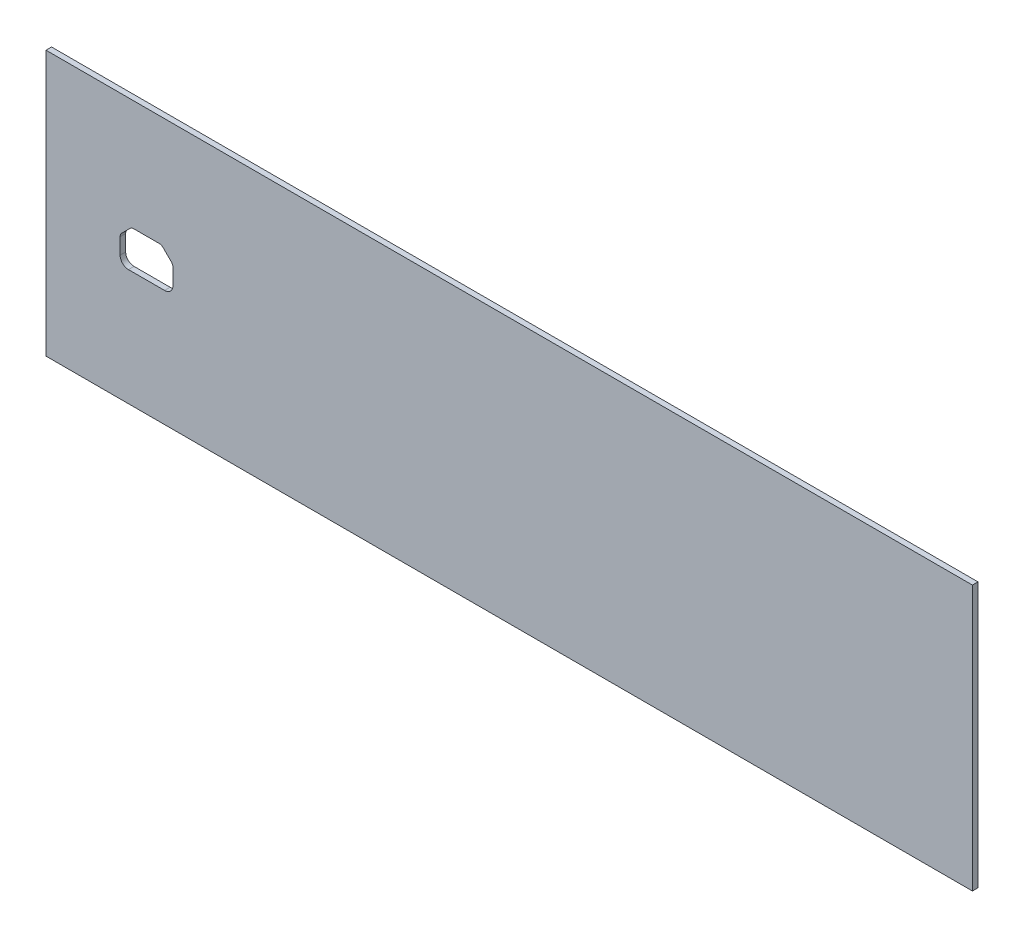
ISO-10303-21;
HEADER;
FILE_DESCRIPTION(('STEP AP214'),'2;1');
FILE_NAME('part.step','',(''),(''),'','','');
FILE_SCHEMA(('AUTOMOTIVE_DESIGN { 1 0 10303 214 1 1 1 1 }'));
ENDSEC;
DATA;
#1=APPLICATION_CONTEXT('core data for automotive mechanical design processes');
#2=APPLICATION_PROTOCOL_DEFINITION('international standard','automotive_design',2000,#1);
#3=PRODUCT_CONTEXT('',#1,'mechanical');
#4=PRODUCT('Part','Part','',(#3));
#5=PRODUCT_RELATED_PRODUCT_CATEGORY('part','',(#4));
#6=PRODUCT_DEFINITION_FORMATION('','',#4);
#7=PRODUCT_DEFINITION_CONTEXT('part definition',#1,'design');
#8=PRODUCT_DEFINITION('design','',#6,#7);
#9=PRODUCT_DEFINITION_SHAPE('','',#8);
#10=(LENGTH_UNIT() NAMED_UNIT(*) SI_UNIT(.MILLI.,.METRE.));
#11=(NAMED_UNIT(*) PLANE_ANGLE_UNIT() SI_UNIT($,.RADIAN.));
#12=(NAMED_UNIT(*) SI_UNIT($,.STERADIAN.) SOLID_ANGLE_UNIT());
#13=UNCERTAINTY_MEASURE_WITH_UNIT(LENGTH_MEASURE(1.E-05),#10,'distance_accuracy_value','');
#14=(GEOMETRIC_REPRESENTATION_CONTEXT(3) GLOBAL_UNCERTAINTY_ASSIGNED_CONTEXT((#13)) GLOBAL_UNIT_ASSIGNED_CONTEXT((#10,
#11,#12)) REPRESENTATION_CONTEXT('',''));
#15=CARTESIAN_POINT('',(0.,0.,0.));
#16=DIRECTION('',(0.,0.,1.));
#17=DIRECTION('',(1.,0.,0.));
#18=AXIS2_PLACEMENT_3D('',#15,#16,#17);
#19=CARTESIAN_POINT('',(0.,0.,3.));
#20=DIRECTION('',(0.,0.,-1.));
#21=DIRECTION('',(-1.,0.,0.));
#22=AXIS2_PLACEMENT_3D('',#19,#20,#21);
#23=PLANE('',#22);
#24=DIRECTION('',(1.,0.,0.));
#25=VECTOR('',#24,1.);
#26=CARTESIAN_POINT('',(250.,-71.5,3.));
#27=LINE('',#26,#25);
#28=CARTESIAN_POINT('',(-250.,-71.5,3.));
#29=VERTEX_POINT('',#28);
#30=CARTESIAN_POINT('',(250.,-71.5,3.));
#31=VERTEX_POINT('',#30);
#32=EDGE_CURVE('E290',#29,#31,#27,.T.);
#33=ORIENTED_EDGE('',*,*,#32,.T.);
#34=DIRECTION('',(0.,1.,0.));
#35=VECTOR('',#34,1.);
#36=CARTESIAN_POINT('',(250.,71.5,3.));
#37=LINE('',#36,#35);
#38=CARTESIAN_POINT('',(250.,71.5,3.));
#39=VERTEX_POINT('',#38);
#40=EDGE_CURVE('E293',#31,#39,#37,.T.);
#41=ORIENTED_EDGE('',*,*,#40,.T.);
#42=DIRECTION('',(-1.,0.,0.));
#43=VECTOR('',#42,1.);
#44=CARTESIAN_POINT('',(-250.,71.5,3.));
#45=LINE('',#44,#43);
#46=CARTESIAN_POINT('',(-250.,71.5,3.));
#47=VERTEX_POINT('',#46);
#48=EDGE_CURVE('E296',#39,#47,#45,.T.);
#49=ORIENTED_EDGE('',*,*,#48,.T.);
#50=DIRECTION('',(0.,-1.,0.));
#51=VECTOR('',#50,1.);
#52=CARTESIAN_POINT('',(-250.,68.5,3.));
#53=LINE('',#52,#51);
#54=EDGE_CURVE('E298',#47,#29,#53,.T.);
#55=ORIENTED_EDGE('',*,*,#54,.T.);
#56=EDGE_LOOP('',(#33,#41,#49,#55));
#57=FACE_BOUND('',#56,.T.);
#58=DIRECTION('',(0.707106781186547,-0.707106781186548,0.));
#59=VECTOR('',#58,1.);
#60=CARTESIAN_POINT('',(-87.9822330470338,-87.9822330470336,3.));
#61=LINE('',#60,#59);
#62=CARTESIAN_POINT('',(-186.792893218813,10.8284271247462,3.));
#63=VERTEX_POINT('',#62);
#64=CARTESIAN_POINT('',(-182.37867965644,6.41421356237311,3.));
#65=VERTEX_POINT('',#64);
#66=EDGE_CURVE('E241',#63,#65,#61,.T.);
#67=ORIENTED_EDGE('',*,*,#66,.T.);
#68=CARTESIAN_POINT('',(-184.5,4.29289321881345,3.));
#69=DIRECTION('',(0.,0.,1.));
#70=DIRECTION('',(1.,0.,0.));
#71=AXIS2_PLACEMENT_3D('',#68,#69,#70);
#72=CIRCLE('',#71,3.);
#73=CARTESIAN_POINT('',(-181.5,4.29289321881345,3.));
#74=VERTEX_POINT('',#73);
#75=EDGE_CURVE('E234',#74,#65,#72,.T.);
#76=ORIENTED_EDGE('',*,*,#75,.F.);
#77=DIRECTION('',(0.,-1.,0.));
#78=VECTOR('',#77,1.);
#79=CARTESIAN_POINT('',(-181.5,0.,3.));
#80=LINE('',#79,#78);
#81=CARTESIAN_POINT('',(-181.5,-4.29289321881346,3.));
#82=VERTEX_POINT('',#81);
#83=EDGE_CURVE('E248',#74,#82,#80,.T.);
#84=ORIENTED_EDGE('',*,*,#83,.T.);
#85=CARTESIAN_POINT('',(-186.,-4.29289321881346,3.));
#86=DIRECTION('',(0.,0.,1.));
#87=DIRECTION('',(1.,0.,0.));
#88=AXIS2_PLACEMENT_3D('',#85,#86,#87);
#89=CIRCLE('',#88,4.5);
#90=CARTESIAN_POINT('',(-186.,-8.79289321881346,3.));
#91=VERTEX_POINT('',#90);
#92=EDGE_CURVE('E237',#91,#82,#89,.T.);
#93=ORIENTED_EDGE('',*,*,#92,.F.);
#94=DIRECTION('',(-1.,0.,0.));
#95=VECTOR('',#94,1.);
#96=CARTESIAN_POINT('',(0.,-8.79289321881346,3.));
#97=LINE('',#96,#95);
#98=CARTESIAN_POINT('',(-205.5,-8.79289321881346,3.));
#99=VERTEX_POINT('',#98);
#100=EDGE_CURVE('E255',#91,#99,#97,.T.);
#101=ORIENTED_EDGE('',*,*,#100,.T.);
#102=CARTESIAN_POINT('',(-205.5,-4.29289321881346,3.));
#103=DIRECTION('',(0.,0.,1.));
#104=DIRECTION('',(1.,0.,0.));
#105=AXIS2_PLACEMENT_3D('',#102,#103,#104);
#106=CIRCLE('',#105,4.5);
#107=CARTESIAN_POINT('',(-210.,-4.29289321881346,3.));
#108=VERTEX_POINT('',#107);
#109=EDGE_CURVE('E547',#108,#99,#106,.T.);
#110=ORIENTED_EDGE('',*,*,#109,.F.);
#111=DIRECTION('',(0.,1.,0.));
#112=VECTOR('',#111,1.);
#113=CARTESIAN_POINT('',(-210.,6.78874430621536E-13,3.));
#114=LINE('',#113,#112);
#115=CARTESIAN_POINT('',(-210.,4.29289321881345,3.));
#116=VERTEX_POINT('',#115);
#117=EDGE_CURVE('E262',#108,#116,#114,.T.);
#118=ORIENTED_EDGE('',*,*,#117,.T.);
#119=CARTESIAN_POINT('',(-207.,4.29289321881345,3.));
#120=DIRECTION('',(0.,0.,1.));
#121=DIRECTION('',(1.,0.,0.));
#122=AXIS2_PLACEMENT_3D('',#119,#120,#121);
#123=CIRCLE('',#122,2.99999999999998);
#124=CARTESIAN_POINT('',(-209.12132034356,6.41421356237309,3.));
#125=VERTEX_POINT('',#124);
#126=EDGE_CURVE('E544',#125,#116,#123,.T.);
#127=ORIENTED_EDGE('',*,*,#126,.F.);
#128=DIRECTION('',(0.707106781186548,0.707106781186548,0.));
#129=VECTOR('',#128,1.);
#130=CARTESIAN_POINT('',(-107.767766952966,107.767766952966,3.));
#131=LINE('',#130,#129);
#132=CARTESIAN_POINT('',(-204.707106781187,10.8284271247462,3.));
#133=VERTEX_POINT('',#132);
#134=EDGE_CURVE('E268',#125,#133,#131,.T.);
#135=ORIENTED_EDGE('',*,*,#134,.T.);
#136=CARTESIAN_POINT('',(-202.585786437627,8.70710678118655,3.));
#137=DIRECTION('',(0.,0.,1.));
#138=DIRECTION('',(1.,0.,0.));
#139=AXIS2_PLACEMENT_3D('',#136,#137,#138);
#140=CIRCLE('',#139,3.);
#141=CARTESIAN_POINT('',(-202.585786437627,11.7071067811865,3.));
#142=VERTEX_POINT('',#141);
#143=EDGE_CURVE('E538',#142,#133,#140,.T.);
#144=ORIENTED_EDGE('',*,*,#143,.F.);
#145=DIRECTION('',(1.,0.,0.));
#146=VECTOR('',#145,1.);
#147=CARTESIAN_POINT('',(0.,11.7071067811865,3.));
#148=LINE('',#147,#146);
#149=CARTESIAN_POINT('',(-188.914213562373,11.7071067811865,3.));
#150=VERTEX_POINT('',#149);
#151=EDGE_CURVE('E272',#142,#150,#148,.T.);
#152=ORIENTED_EDGE('',*,*,#151,.T.);
#153=CARTESIAN_POINT('',(-188.914213562373,8.70710678118655,3.));
#154=DIRECTION('',(0.,0.,1.));
#155=DIRECTION('',(1.,0.,0.));
#156=AXIS2_PLACEMENT_3D('',#153,#154,#155);
#157=CIRCLE('',#156,3.);
#158=EDGE_CURVE('E120',#63,#150,#157,.T.);
#159=ORIENTED_EDGE('',*,*,#158,.F.);
#160=EDGE_LOOP('',(#67,#76,#84,#93,#101,#110,#118,#127,#135,#144,#152,#159));
#161=FACE_BOUND('',#160,.T.);
#162=ADVANCED_FACE('F105',(#57,#161),#23,.F.);
#163=CARTESIAN_POINT('',(0.,0.,0.));
#164=DIRECTION('',(0.,0.,-1.));
#165=DIRECTION('',(-1.,0.,0.));
#166=AXIS2_PLACEMENT_3D('',#163,#164,#165);
#167=PLANE('',#166);
#168=DIRECTION('',(1.,0.,0.));
#169=VECTOR('',#168,1.);
#170=CARTESIAN_POINT('',(250.,-71.5,0.));
#171=LINE('',#170,#169);
#172=CARTESIAN_POINT('',(-250.,-71.5,0.));
#173=VERTEX_POINT('',#172);
#174=CARTESIAN_POINT('',(250.,-71.5,0.));
#175=VERTEX_POINT('',#174);
#176=EDGE_CURVE('E301',#173,#175,#171,.T.);
#177=ORIENTED_EDGE('',*,*,#176,.F.);
#178=DIRECTION('',(0.,-1.,0.));
#179=VECTOR('',#178,1.);
#180=CARTESIAN_POINT('',(-250.,-71.5,0.));
#181=LINE('',#180,#179);
#182=CARTESIAN_POINT('',(-250.,71.5,0.));
#183=VERTEX_POINT('',#182);
#184=EDGE_CURVE('E294',#183,#173,#181,.T.);
#185=ORIENTED_EDGE('',*,*,#184,.F.);
#186=DIRECTION('',(-1.,0.,0.));
#187=VECTOR('',#186,1.);
#188=CARTESIAN_POINT('',(-250.,71.5,0.));
#189=LINE('',#188,#187);
#190=CARTESIAN_POINT('',(250.,71.5,0.));
#191=VERTEX_POINT('',#190);
#192=EDGE_CURVE('E306',#191,#183,#189,.T.);
#193=ORIENTED_EDGE('',*,*,#192,.F.);
#194=DIRECTION('',(0.,1.,0.));
#195=VECTOR('',#194,1.);
#196=CARTESIAN_POINT('',(250.,71.5,0.));
#197=LINE('',#196,#195);
#198=EDGE_CURVE('E304',#175,#191,#197,.T.);
#199=ORIENTED_EDGE('',*,*,#198,.F.);
#200=EDGE_LOOP('',(#177,#185,#193,#199));
#201=FACE_BOUND('',#200,.T.);
#202=CARTESIAN_POINT('',(-184.5,4.29289321881345,0.));
#203=DIRECTION('',(0.,0.,-1.));
#204=DIRECTION('',(-1.,0.,0.));
#205=AXIS2_PLACEMENT_3D('',#202,#203,#204);
#206=CIRCLE('',#205,3.);
#207=CARTESIAN_POINT('',(-181.5,4.29289321881345,0.));
#208=VERTEX_POINT('',#207);
#209=CARTESIAN_POINT('',(-182.37867965644,6.4142135623731,0.));
#210=VERTEX_POINT('',#209);
#211=EDGE_CURVE('E245',#208,#210,#206,.F.);
#212=ORIENTED_EDGE('',*,*,#211,.T.);
#213=DIRECTION('',(0.707106781186547,-0.707106781186548,0.));
#214=VECTOR('',#213,1.);
#215=CARTESIAN_POINT('',(-87.9822330470338,-87.9822330470336,0.));
#216=LINE('',#215,#214);
#217=CARTESIAN_POINT('',(-186.792893218813,10.8284271247462,0.));
#218=VERTEX_POINT('',#217);
#219=EDGE_CURVE('E233',#218,#210,#216,.T.);
#220=ORIENTED_EDGE('',*,*,#219,.F.);
#221=CARTESIAN_POINT('',(-188.914213562373,8.70710678118655,0.));
#222=DIRECTION('',(0.,0.,-1.));
#223=DIRECTION('',(-1.,0.,0.));
#224=AXIS2_PLACEMENT_3D('',#221,#222,#223);
#225=CIRCLE('',#224,3.);
#226=CARTESIAN_POINT('',(-188.914213562373,11.7071067811865,0.));
#227=VERTEX_POINT('',#226);
#228=EDGE_CURVE('E227',#218,#227,#225,.F.);
#229=ORIENTED_EDGE('',*,*,#228,.T.);
#230=DIRECTION('',(1.,0.,0.));
#231=VECTOR('',#230,1.);
#232=CARTESIAN_POINT('',(0.,11.7071067811865,0.));
#233=LINE('',#232,#231);
#234=CARTESIAN_POINT('',(-202.585786437627,11.7071067811865,0.));
#235=VERTEX_POINT('',#234);
#236=EDGE_CURVE('E217',#235,#227,#233,.T.);
#237=ORIENTED_EDGE('',*,*,#236,.F.);
#238=CARTESIAN_POINT('',(-202.585786437627,8.70710678118655,0.));
#239=DIRECTION('',(0.,0.,-1.));
#240=DIRECTION('',(-1.,0.,0.));
#241=AXIS2_PLACEMENT_3D('',#238,#239,#240);
#242=CIRCLE('',#241,3.);
#243=CARTESIAN_POINT('',(-204.707106781187,10.8284271247462,0.));
#244=VERTEX_POINT('',#243);
#245=EDGE_CURVE('E270',#235,#244,#242,.F.);
#246=ORIENTED_EDGE('',*,*,#245,.T.);
#247=DIRECTION('',(0.707106781186548,0.707106781186548,0.));
#248=VECTOR('',#247,1.);
#249=CARTESIAN_POINT('',(-107.767766952966,107.767766952966,0.));
#250=LINE('',#249,#248);
#251=CARTESIAN_POINT('',(-209.12132034356,6.41421356237309,0.));
#252=VERTEX_POINT('',#251);
#253=EDGE_CURVE('E224',#252,#244,#250,.T.);
#254=ORIENTED_EDGE('',*,*,#253,.F.);
#255=CARTESIAN_POINT('',(-207.,4.29289321881345,0.));
#256=DIRECTION('',(0.,0.,-1.));
#257=DIRECTION('',(-1.,0.,0.));
#258=AXIS2_PLACEMENT_3D('',#255,#256,#257);
#259=CIRCLE('',#258,2.99999999999998);
#260=CARTESIAN_POINT('',(-210.,4.29289321881345,0.));
#261=VERTEX_POINT('',#260);
#262=EDGE_CURVE('E264',#252,#261,#259,.F.);
#263=ORIENTED_EDGE('',*,*,#262,.T.);
#264=DIRECTION('',(0.,1.,0.));
#265=VECTOR('',#264,1.);
#266=CARTESIAN_POINT('',(-210.,6.78874430621536E-13,0.));
#267=LINE('',#266,#265);
#268=CARTESIAN_POINT('',(-210.,-4.29289321881346,0.));
#269=VERTEX_POINT('',#268);
#270=EDGE_CURVE('E257',#269,#261,#267,.T.);
#271=ORIENTED_EDGE('',*,*,#270,.F.);
#272=CARTESIAN_POINT('',(-205.5,-4.29289321881346,0.));
#273=DIRECTION('',(0.,0.,-1.));
#274=DIRECTION('',(-1.,0.,0.));
#275=AXIS2_PLACEMENT_3D('',#272,#273,#274);
#276=CIRCLE('',#275,4.5);
#277=CARTESIAN_POINT('',(-205.5,-8.79289321881346,0.));
#278=VERTEX_POINT('',#277);
#279=EDGE_CURVE('E258',#269,#278,#276,.F.);
#280=ORIENTED_EDGE('',*,*,#279,.T.);
#281=DIRECTION('',(-1.,0.,0.));
#282=VECTOR('',#281,1.);
#283=CARTESIAN_POINT('',(0.,-8.79289321881346,0.));
#284=LINE('',#283,#282);
#285=CARTESIAN_POINT('',(-186.,-8.79289321881346,0.));
#286=VERTEX_POINT('',#285);
#287=EDGE_CURVE('E250',#286,#278,#284,.T.);
#288=ORIENTED_EDGE('',*,*,#287,.F.);
#289=CARTESIAN_POINT('',(-186.,-4.29289321881346,0.));
#290=DIRECTION('',(0.,0.,-1.));
#291=DIRECTION('',(-1.,0.,0.));
#292=AXIS2_PLACEMENT_3D('',#289,#290,#291);
#293=CIRCLE('',#292,4.5);
#294=CARTESIAN_POINT('',(-181.5,-4.29289321881346,0.));
#295=VERTEX_POINT('',#294);
#296=EDGE_CURVE('E251',#286,#295,#293,.F.);
#297=ORIENTED_EDGE('',*,*,#296,.T.);
#298=DIRECTION('',(0.,-1.,0.));
#299=VECTOR('',#298,1.);
#300=CARTESIAN_POINT('',(-181.5,0.,0.));
#301=LINE('',#300,#299);
#302=EDGE_CURVE('E244',#208,#295,#301,.T.);
#303=ORIENTED_EDGE('',*,*,#302,.F.);
#304=EDGE_LOOP('',(#212,#220,#229,#237,#246,#254,#263,#271,#280,#288,#297,#303));
#305=FACE_BOUND('',#304,.T.);
#306=ADVANCED_FACE('F232',(#201,#305),#167,.T.);
#307=CARTESIAN_POINT('',(250.,-71.5,3.));
#308=DIRECTION('',(0.,1.,0.));
#309=DIRECTION('',(0.,0.,1.));
#310=AXIS2_PLACEMENT_3D('',#307,#308,#309);
#311=PLANE('',#310);
#312=ORIENTED_EDGE('',*,*,#176,.T.);
#313=DIRECTION('',(0.,0.,-1.));
#314=VECTOR('',#313,1.);
#315=CARTESIAN_POINT('',(250.,-71.5,3.));
#316=LINE('',#315,#314);
#317=EDGE_CURVE('E12',#31,#175,#316,.T.);
#318=ORIENTED_EDGE('',*,*,#317,.F.);
#319=ORIENTED_EDGE('',*,*,#32,.F.);
#320=DIRECTION('',(0.,0.,-1.));
#321=VECTOR('',#320,1.);
#322=CARTESIAN_POINT('',(-250.,-71.5,3.));
#323=LINE('',#322,#321);
#324=EDGE_CURVE('E300',#29,#173,#323,.T.);
#325=ORIENTED_EDGE('',*,*,#324,.T.);
#326=EDGE_LOOP('',(#312,#318,#319,#325));
#327=FACE_BOUND('',#326,.T.);
#328=ADVANCED_FACE('F107',(#327),#311,.F.);
#329=CARTESIAN_POINT('',(250.,71.5,3.));
#330=DIRECTION('',(-1.,0.,0.));
#331=DIRECTION('',(0.,0.,1.));
#332=AXIS2_PLACEMENT_3D('',#329,#330,#331);
#333=PLANE('',#332);
#334=ORIENTED_EDGE('',*,*,#198,.T.);
#335=DIRECTION('',(0.,0.,-1.));
#336=VECTOR('',#335,1.);
#337=CARTESIAN_POINT('',(250.,71.5,3.));
#338=LINE('',#337,#336);
#339=EDGE_CURVE('E113',#39,#191,#338,.T.);
#340=ORIENTED_EDGE('',*,*,#339,.F.);
#341=ORIENTED_EDGE('',*,*,#40,.F.);
#342=ORIENTED_EDGE('',*,*,#317,.T.);
#343=EDGE_LOOP('',(#334,#340,#341,#342));
#344=FACE_BOUND('',#343,.T.);
#345=ADVANCED_FACE('F333',(#344),#333,.F.);
#346=CARTESIAN_POINT('',(-250.,71.5,3.));
#347=DIRECTION('',(0.,-1.,0.));
#348=DIRECTION('',(0.,0.,-1.));
#349=AXIS2_PLACEMENT_3D('',#346,#347,#348);
#350=PLANE('',#349);
#351=ORIENTED_EDGE('',*,*,#192,.T.);
#352=DIRECTION('',(0.,0.,-1.));
#353=VECTOR('',#352,1.);
#354=CARTESIAN_POINT('',(-250.,71.5,3.));
#355=LINE('',#354,#353);
#356=EDGE_CURVE('E312',#47,#183,#355,.T.);
#357=ORIENTED_EDGE('',*,*,#356,.F.);
#358=ORIENTED_EDGE('',*,*,#48,.F.);
#359=ORIENTED_EDGE('',*,*,#339,.T.);
#360=EDGE_LOOP('',(#351,#357,#358,#359));
#361=FACE_BOUND('',#360,.T.);
#362=ADVANCED_FACE('F319',(#361),#350,.F.);
#363=CARTESIAN_POINT('',(-250.,-71.5,3.));
#364=DIRECTION('',(1.,0.,0.));
#365=DIRECTION('',(0.,0.,-1.));
#366=AXIS2_PLACEMENT_3D('',#363,#364,#365);
#367=PLANE('',#366);
#368=ORIENTED_EDGE('',*,*,#184,.T.);
#369=ORIENTED_EDGE('',*,*,#324,.F.);
#370=ORIENTED_EDGE('',*,*,#54,.F.);
#371=ORIENTED_EDGE('',*,*,#356,.T.);
#372=EDGE_LOOP('',(#368,#369,#370,#371));
#373=FACE_BOUND('',#372,.T.);
#374=ADVANCED_FACE('F326',(#373),#367,.F.);
#375=CARTESIAN_POINT('',(-87.9822330470338,-87.9822330470336,-35.1069793630839));
#376=DIRECTION('',(-0.707106781186548,-0.707106781186547,0.));
#377=DIRECTION('',(0.707106781186547,-0.707106781186548,0.));
#378=AXIS2_PLACEMENT_3D('',#375,#376,#377);
#379=PLANE('',#378);
#380=ORIENTED_EDGE('',*,*,#219,.T.);
#381=DIRECTION('',(0.,0.,1.));
#382=VECTOR('',#381,1.);
#383=CARTESIAN_POINT('',(-182.37867965644,6.41421356237311,-35.1069793630839));
#384=LINE('',#383,#382);
#385=EDGE_CURVE('E247',#210,#65,#384,.T.);
#386=ORIENTED_EDGE('',*,*,#385,.T.);
#387=ORIENTED_EDGE('',*,*,#66,.F.);
#388=DIRECTION('',(0.,0.,1.));
#389=VECTOR('',#388,1.);
#390=CARTESIAN_POINT('',(-186.792893218813,10.8284271247462,-35.1069793630839));
#391=LINE('',#390,#389);
#392=EDGE_CURVE('E275',#218,#63,#391,.T.);
#393=ORIENTED_EDGE('',*,*,#392,.F.);
#394=EDGE_LOOP('',(#380,#386,#387,#393));
#395=FACE_BOUND('',#394,.T.);
#396=ADVANCED_FACE('F351',(#395),#379,.T.);
#397=CARTESIAN_POINT('',(-184.5,4.29289321881345,-35.1069793630839));
#398=DIRECTION('',(0.,0.,1.));
#399=DIRECTION('',(1.,0.,0.));
#400=AXIS2_PLACEMENT_3D('',#397,#398,#399);
#401=CYLINDRICAL_SURFACE('',#400,3.);
#402=DIRECTION('',(0.,0.,1.));
#403=VECTOR('',#402,1.);
#404=CARTESIAN_POINT('',(-181.5,4.29289321881345,-35.1069793630839));
#405=LINE('',#404,#403);
#406=EDGE_CURVE('E276',#208,#74,#405,.T.);
#407=ORIENTED_EDGE('',*,*,#406,.T.);
#408=ORIENTED_EDGE('',*,*,#75,.T.);
#409=ORIENTED_EDGE('',*,*,#385,.F.);
#410=ORIENTED_EDGE('',*,*,#211,.F.);
#411=EDGE_LOOP('',(#407,#408,#409,#410));
#412=FACE_BOUND('',#411,.T.);
#413=ADVANCED_FACE('F355',(#412),#401,.F.);
#414=CARTESIAN_POINT('',(-188.914213562373,8.70710678118655,-35.1069793630839));
#415=DIRECTION('',(0.,0.,1.));
#416=DIRECTION('',(1.,0.,0.));
#417=AXIS2_PLACEMENT_3D('',#414,#415,#416);
#418=CYLINDRICAL_SURFACE('',#417,3.);
#419=ORIENTED_EDGE('',*,*,#392,.T.);
#420=ORIENTED_EDGE('',*,*,#158,.T.);
#421=DIRECTION('',(0.,0.,1.));
#422=VECTOR('',#421,1.);
#423=CARTESIAN_POINT('',(-188.914213562373,11.7071067811865,-35.1069793630839));
#424=LINE('',#423,#422);
#425=EDGE_CURVE('E219',#227,#150,#424,.T.);
#426=ORIENTED_EDGE('',*,*,#425,.F.);
#427=ORIENTED_EDGE('',*,*,#228,.F.);
#428=EDGE_LOOP('',(#419,#420,#426,#427));
#429=FACE_BOUND('',#428,.T.);
#430=ADVANCED_FACE('F226',(#429),#418,.F.);
#431=CARTESIAN_POINT('',(-181.5,0.,-35.1069793630839));
#432=DIRECTION('',(-1.,0.,0.));
#433=DIRECTION('',(0.,0.,1.));
#434=AXIS2_PLACEMENT_3D('',#431,#432,#433);
#435=PLANE('',#434);
#436=ORIENTED_EDGE('',*,*,#302,.T.);
#437=DIRECTION('',(0.,0.,1.));
#438=VECTOR('',#437,1.);
#439=CARTESIAN_POINT('',(-181.5,-4.29289321881346,-35.1069793630839));
#440=LINE('',#439,#438);
#441=EDGE_CURVE('E254',#295,#82,#440,.T.);
#442=ORIENTED_EDGE('',*,*,#441,.T.);
#443=ORIENTED_EDGE('',*,*,#83,.F.);
#444=ORIENTED_EDGE('',*,*,#406,.F.);
#445=EDGE_LOOP('',(#436,#442,#443,#444));
#446=FACE_BOUND('',#445,.T.);
#447=ADVANCED_FACE('F365',(#446),#435,.T.);
#448=CARTESIAN_POINT('',(-186.,-4.29289321881346,-35.1069793630839));
#449=DIRECTION('',(0.,0.,1.));
#450=DIRECTION('',(1.,0.,0.));
#451=AXIS2_PLACEMENT_3D('',#448,#449,#450);
#452=CYLINDRICAL_SURFACE('',#451,4.5);
#453=DIRECTION('',(0.,0.,1.));
#454=VECTOR('',#453,1.);
#455=CARTESIAN_POINT('',(-186.,-8.79289321881346,-35.1069793630839));
#456=LINE('',#455,#454);
#457=EDGE_CURVE('E279',#286,#91,#456,.T.);
#458=ORIENTED_EDGE('',*,*,#457,.T.);
#459=ORIENTED_EDGE('',*,*,#92,.T.);
#460=ORIENTED_EDGE('',*,*,#441,.F.);
#461=ORIENTED_EDGE('',*,*,#296,.F.);
#462=EDGE_LOOP('',(#458,#459,#460,#461));
#463=FACE_BOUND('',#462,.T.);
#464=ADVANCED_FACE('F368',(#463),#452,.F.);
#465=CARTESIAN_POINT('',(0.,-8.79289321881346,-35.1069793630839));
#466=DIRECTION('',(0.,1.,0.));
#467=DIRECTION('',(0.,0.,1.));
#468=AXIS2_PLACEMENT_3D('',#465,#466,#467);
#469=PLANE('',#468);
#470=ORIENTED_EDGE('',*,*,#287,.T.);
#471=DIRECTION('',(0.,0.,1.));
#472=VECTOR('',#471,1.);
#473=CARTESIAN_POINT('',(-205.5,-8.79289321881346,-35.1069793630839));
#474=LINE('',#473,#472);
#475=EDGE_CURVE('E261',#278,#99,#474,.T.);
#476=ORIENTED_EDGE('',*,*,#475,.T.);
#477=ORIENTED_EDGE('',*,*,#100,.F.);
#478=ORIENTED_EDGE('',*,*,#457,.F.);
#479=EDGE_LOOP('',(#470,#476,#477,#478));
#480=FACE_BOUND('',#479,.T.);
#481=ADVANCED_FACE('F372',(#480),#469,.T.);
#482=CARTESIAN_POINT('',(-205.5,-4.29289321881346,-35.1069793630839));
#483=DIRECTION('',(0.,0.,1.));
#484=DIRECTION('',(1.,0.,0.));
#485=AXIS2_PLACEMENT_3D('',#482,#483,#484);
#486=CYLINDRICAL_SURFACE('',#485,4.5);
#487=DIRECTION('',(0.,0.,1.));
#488=VECTOR('',#487,1.);
#489=CARTESIAN_POINT('',(-210.,-4.29289321881346,-35.1069793630839));
#490=LINE('',#489,#488);
#491=EDGE_CURVE('E282',#269,#108,#490,.T.);
#492=ORIENTED_EDGE('',*,*,#491,.T.);
#493=ORIENTED_EDGE('',*,*,#109,.T.);
#494=ORIENTED_EDGE('',*,*,#475,.F.);
#495=ORIENTED_EDGE('',*,*,#279,.F.);
#496=EDGE_LOOP('',(#492,#493,#494,#495));
#497=FACE_BOUND('',#496,.T.);
#498=ADVANCED_FACE('F376',(#497),#486,.F.);
#499=CARTESIAN_POINT('',(-210.,6.78874430621536E-13,-35.1069793630839));
#500=DIRECTION('',(1.,0.,0.));
#501=DIRECTION('',(0.,1.,0.));
#502=AXIS2_PLACEMENT_3D('',#499,#500,#501);
#503=PLANE('',#502);
#504=ORIENTED_EDGE('',*,*,#270,.T.);
#505=DIRECTION('',(0.,0.,1.));
#506=VECTOR('',#505,1.);
#507=CARTESIAN_POINT('',(-210.,4.29289321881345,-35.1069793630839));
#508=LINE('',#507,#506);
#509=EDGE_CURVE('E267',#261,#116,#508,.T.);
#510=ORIENTED_EDGE('',*,*,#509,.T.);
#511=ORIENTED_EDGE('',*,*,#117,.F.);
#512=ORIENTED_EDGE('',*,*,#491,.F.);
#513=EDGE_LOOP('',(#504,#510,#511,#512));
#514=FACE_BOUND('',#513,.T.);
#515=ADVANCED_FACE('F380',(#514),#503,.T.);
#516=CARTESIAN_POINT('',(-207.,4.29289321881345,-35.1069793630839));
#517=DIRECTION('',(0.,0.,1.));
#518=DIRECTION('',(1.,0.,0.));
#519=AXIS2_PLACEMENT_3D('',#516,#517,#518);
#520=CYLINDRICAL_SURFACE('',#519,2.99999999999998);
#521=DIRECTION('',(0.,0.,1.));
#522=VECTOR('',#521,1.);
#523=CARTESIAN_POINT('',(-209.12132034356,6.41421356237309,-35.1069793630839));
#524=LINE('',#523,#522);
#525=EDGE_CURVE('E285',#252,#125,#524,.T.);
#526=ORIENTED_EDGE('',*,*,#525,.T.);
#527=ORIENTED_EDGE('',*,*,#126,.T.);
#528=ORIENTED_EDGE('',*,*,#509,.F.);
#529=ORIENTED_EDGE('',*,*,#262,.F.);
#530=EDGE_LOOP('',(#526,#527,#528,#529));
#531=FACE_BOUND('',#530,.T.);
#532=ADVANCED_FACE('F384',(#531),#520,.F.);
#533=CARTESIAN_POINT('',(-107.767766952966,107.767766952966,-35.1069793630839));
#534=DIRECTION('',(0.707106781186548,-0.707106781186548,0.));
#535=DIRECTION('',(0.707106781186548,0.707106781186548,0.));
#536=AXIS2_PLACEMENT_3D('',#533,#534,#535);
#537=PLANE('',#536);
#538=ORIENTED_EDGE('',*,*,#253,.T.);
#539=DIRECTION('',(0.,0.,1.));
#540=VECTOR('',#539,1.);
#541=CARTESIAN_POINT('',(-204.707106781187,10.8284271247462,-35.1069793630839));
#542=LINE('',#541,#540);
#543=EDGE_CURVE('E271',#244,#133,#542,.T.);
#544=ORIENTED_EDGE('',*,*,#543,.T.);
#545=ORIENTED_EDGE('',*,*,#134,.F.);
#546=ORIENTED_EDGE('',*,*,#525,.F.);
#547=EDGE_LOOP('',(#538,#544,#545,#546));
#548=FACE_BOUND('',#547,.T.);
#549=ADVANCED_FACE('F388',(#548),#537,.T.);
#550=CARTESIAN_POINT('',(-202.585786437627,8.70710678118655,-35.1069793630839));
#551=DIRECTION('',(0.,0.,1.));
#552=DIRECTION('',(1.,0.,0.));
#553=AXIS2_PLACEMENT_3D('',#550,#551,#552);
#554=CYLINDRICAL_SURFACE('',#553,3.);
#555=DIRECTION('',(0.,0.,1.));
#556=VECTOR('',#555,1.);
#557=CARTESIAN_POINT('',(-202.585786437627,11.7071067811865,-35.1069793630839));
#558=LINE('',#557,#556);
#559=EDGE_CURVE('E128',#235,#142,#558,.T.);
#560=ORIENTED_EDGE('',*,*,#559,.T.);
#561=ORIENTED_EDGE('',*,*,#143,.T.);
#562=ORIENTED_EDGE('',*,*,#543,.F.);
#563=ORIENTED_EDGE('',*,*,#245,.F.);
#564=EDGE_LOOP('',(#560,#561,#562,#563));
#565=FACE_BOUND('',#564,.T.);
#566=ADVANCED_FACE('F392',(#565),#554,.F.);
#567=CARTESIAN_POINT('',(0.,11.7071067811865,-35.1069793630839));
#568=DIRECTION('',(0.,-1.,0.));
#569=DIRECTION('',(1.,0.,0.));
#570=AXIS2_PLACEMENT_3D('',#567,#568,#569);
#571=PLANE('',#570);
#572=ORIENTED_EDGE('',*,*,#236,.T.);
#573=ORIENTED_EDGE('',*,*,#425,.T.);
#574=ORIENTED_EDGE('',*,*,#151,.F.);
#575=ORIENTED_EDGE('',*,*,#559,.F.);
#576=EDGE_LOOP('',(#572,#573,#574,#575));
#577=FACE_BOUND('',#576,.T.);
#578=ADVANCED_FACE('F218',(#577),#571,.T.);
#579=CLOSED_SHELL('',(#162,#306,#328,#345,#362,#374,#396,#413,#430,#447,#464,#481,#498,#515,
#532,#549,#566,#578));
#580=MANIFOLD_SOLID_BREP('B2',#579);
#581=ADVANCED_BREP_SHAPE_REPRESENTATION('',(#18,#580),#14);
#582=SHAPE_DEFINITION_REPRESENTATION(#9,#581);
ENDSEC;
END-ISO-10303-21;
